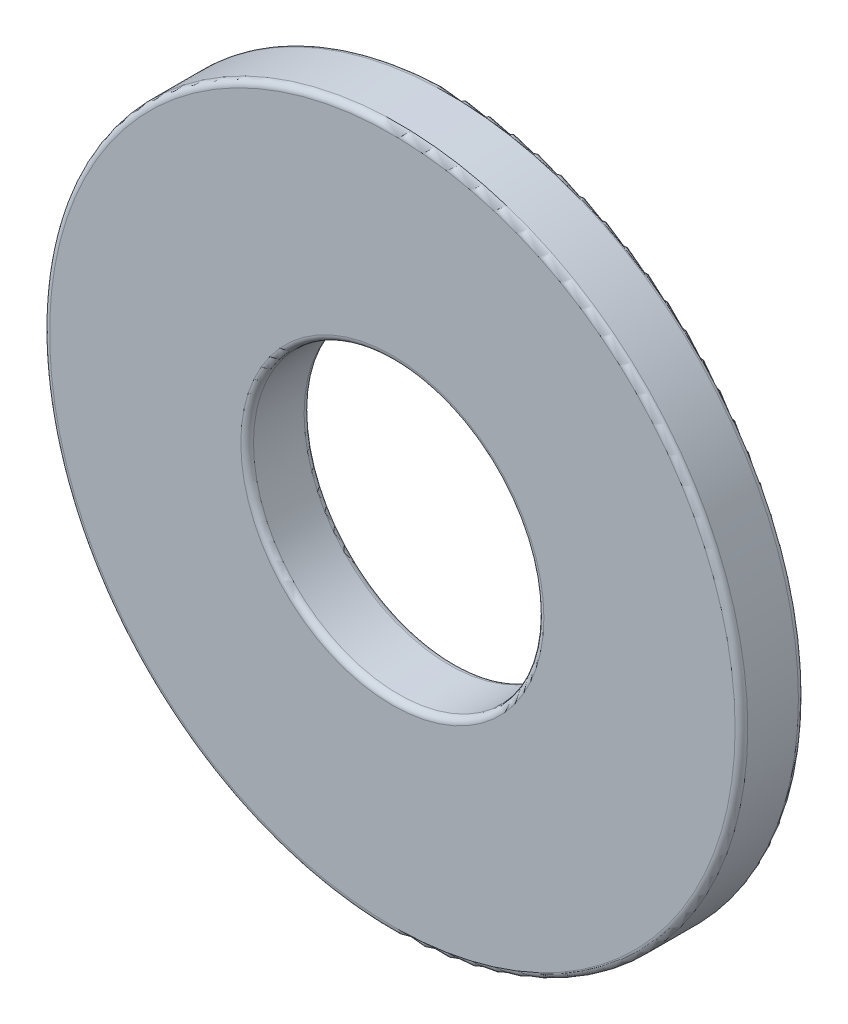
ISO-10303-21;
HEADER;
FILE_DESCRIPTION(('STEP AP214'),'2;1');
FILE_NAME('part.step','',(''),(''),'','','');
FILE_SCHEMA(('AUTOMOTIVE_DESIGN { 1 0 10303 214 1 1 1 1 }'));
ENDSEC;
DATA;
#1=APPLICATION_CONTEXT('core data for automotive mechanical design processes');
#2=APPLICATION_PROTOCOL_DEFINITION('international standard','automotive_design',2000,#1);
#3=PRODUCT_CONTEXT('',#1,'mechanical');
#4=PRODUCT('Part','Part','',(#3));
#5=PRODUCT_RELATED_PRODUCT_CATEGORY('part','',(#4));
#6=PRODUCT_DEFINITION_FORMATION('','',#4);
#7=PRODUCT_DEFINITION_CONTEXT('part definition',#1,'design');
#8=PRODUCT_DEFINITION('design','',#6,#7);
#9=PRODUCT_DEFINITION_SHAPE('','',#8);
#10=(LENGTH_UNIT() NAMED_UNIT(*) SI_UNIT(.MILLI.,.METRE.));
#11=(NAMED_UNIT(*) PLANE_ANGLE_UNIT() SI_UNIT($,.RADIAN.));
#12=(NAMED_UNIT(*) SI_UNIT($,.STERADIAN.) SOLID_ANGLE_UNIT());
#13=UNCERTAINTY_MEASURE_WITH_UNIT(LENGTH_MEASURE(1.E-05),#10,'distance_accuracy_value','');
#14=(GEOMETRIC_REPRESENTATION_CONTEXT(3) GLOBAL_UNCERTAINTY_ASSIGNED_CONTEXT((#13)) GLOBAL_UNIT_ASSIGNED_CONTEXT((#10,
#11,#12)) REPRESENTATION_CONTEXT('',''));
#15=CARTESIAN_POINT('',(0.,0.,0.));
#16=DIRECTION('',(0.,0.,1.));
#17=DIRECTION('',(1.,0.,0.));
#18=AXIS2_PLACEMENT_3D('',#15,#16,#17);
#19=CARTESIAN_POINT('',(0.,0.,-0.8636));
#20=DIRECTION('',(0.,0.,1.));
#21=DIRECTION('',(1.,0.,0.));
#22=AXIS2_PLACEMENT_3D('',#19,#20,#21);
#23=CYLINDRICAL_SURFACE('',#22,9.525);
#24=CARTESIAN_POINT('',(0.,0.,-0.69088));
#25=DIRECTION('',(0.,0.,1.));
#26=DIRECTION('',(1.,0.,0.));
#27=AXIS2_PLACEMENT_3D('',#24,#25,#26);
#28=CIRCLE('',#27,9.525);
#29=CARTESIAN_POINT('',(9.525,0.,-0.69088));
#30=VERTEX_POINT('',#29);
#31=EDGE_CURVE('E56',#30,#30,#28,.T.);
#32=ORIENTED_EDGE('',*,*,#31,.T.);
#33=EDGE_LOOP('',(#32));
#34=FACE_BOUND('',#33,.T.);
#35=CARTESIAN_POINT('',(0.,0.,0.69088));
#36=DIRECTION('',(0.,0.,1.));
#37=DIRECTION('',(1.,0.,0.));
#38=AXIS2_PLACEMENT_3D('',#35,#36,#37);
#39=CIRCLE('',#38,9.525);
#40=CARTESIAN_POINT('',(9.525,0.,0.69088));
#41=VERTEX_POINT('',#40);
#42=EDGE_CURVE('E59',#41,#41,#39,.F.);
#43=ORIENTED_EDGE('',*,*,#42,.T.);
#44=EDGE_LOOP('',(#43));
#45=FACE_BOUND('',#44,.T.);
#46=ADVANCED_FACE('F30',(#34,#45),#23,.T.);
#47=CARTESIAN_POINT('',(0.,0.,-0.8636));
#48=DIRECTION('',(0.,0.,1.));
#49=DIRECTION('',(1.,0.,0.));
#50=AXIS2_PLACEMENT_3D('',#47,#48,#49);
#51=PLANE('',#50);
#52=CARTESIAN_POINT('',(0.,0.,-0.8636));
#53=DIRECTION('',(0.,0.,1.));
#54=DIRECTION('',(1.,0.,0.));
#55=AXIS2_PLACEMENT_3D('',#52,#53,#54);
#56=CIRCLE('',#55,9.35228);
#57=CARTESIAN_POINT('',(9.35228,0.,-0.8636));
#58=VERTEX_POINT('',#57);
#59=EDGE_CURVE('E50',#58,#58,#56,.F.);
#60=ORIENTED_EDGE('',*,*,#59,.T.);
#61=EDGE_LOOP('',(#60));
#62=FACE_BOUND('',#61,.T.);
#63=CARTESIAN_POINT('',(0.,0.,-0.8636));
#64=DIRECTION('',(0.,0.,1.));
#65=DIRECTION('',(1.,0.,0.));
#66=AXIS2_PLACEMENT_3D('',#63,#64,#65);
#67=CIRCLE('',#66,4.13512);
#68=CARTESIAN_POINT('',(4.13512,0.,-0.8636));
#69=VERTEX_POINT('',#68);
#70=EDGE_CURVE('E53',#69,#69,#67,.T.);
#71=ORIENTED_EDGE('',*,*,#70,.T.);
#72=EDGE_LOOP('',(#71));
#73=FACE_BOUND('',#72,.T.);
#74=ADVANCED_FACE('F73',(#62,#73),#51,.F.);
#75=CARTESIAN_POINT('',(0.,0.,-0.8636));
#76=DIRECTION('',(0.,0.,1.));
#77=DIRECTION('',(1.,0.,0.));
#78=AXIS2_PLACEMENT_3D('',#75,#76,#77);
#79=CYLINDRICAL_SURFACE('',#78,3.9624);
#80=CARTESIAN_POINT('',(0.,0.,-0.69088));
#81=DIRECTION('',(0.,0.,1.));
#82=DIRECTION('',(1.,0.,0.));
#83=AXIS2_PLACEMENT_3D('',#80,#81,#82);
#84=CIRCLE('',#83,3.9624);
#85=CARTESIAN_POINT('',(3.9624,0.,-0.69088));
#86=VERTEX_POINT('',#85);
#87=EDGE_CURVE('E41',#86,#86,#84,.F.);
#88=ORIENTED_EDGE('',*,*,#87,.T.);
#89=EDGE_LOOP('',(#88));
#90=FACE_BOUND('',#89,.T.);
#91=CARTESIAN_POINT('',(0.,0.,0.69088));
#92=DIRECTION('',(0.,0.,1.));
#93=DIRECTION('',(1.,0.,0.));
#94=AXIS2_PLACEMENT_3D('',#91,#92,#93);
#95=CIRCLE('',#94,3.9624);
#96=CARTESIAN_POINT('',(3.9624,0.,0.69088));
#97=VERTEX_POINT('',#96);
#98=EDGE_CURVE('E45',#97,#97,#95,.T.);
#99=ORIENTED_EDGE('',*,*,#98,.T.);
#100=EDGE_LOOP('',(#99));
#101=FACE_BOUND('',#100,.T.);
#102=ADVANCED_FACE('F79',(#90,#101),#79,.F.);
#103=CARTESIAN_POINT('',(0.,0.,0.8636));
#104=DIRECTION('',(0.,0.,1.));
#105=DIRECTION('',(1.,0.,0.));
#106=AXIS2_PLACEMENT_3D('',#103,#104,#105);
#107=PLANE('',#106);
#108=CARTESIAN_POINT('',(0.,0.,0.8636));
#109=DIRECTION('',(0.,0.,1.));
#110=DIRECTION('',(1.,0.,0.));
#111=AXIS2_PLACEMENT_3D('',#108,#109,#110);
#112=CIRCLE('',#111,4.13512);
#113=CARTESIAN_POINT('',(4.13512,0.,0.8636));
#114=VERTEX_POINT('',#113);
#115=EDGE_CURVE('E10',#114,#114,#112,.F.);
#116=ORIENTED_EDGE('',*,*,#115,.T.);
#117=EDGE_LOOP('',(#116));
#118=FACE_BOUND('',#117,.T.);
#119=CARTESIAN_POINT('',(0.,0.,0.8636));
#120=DIRECTION('',(0.,0.,1.));
#121=DIRECTION('',(1.,0.,0.));
#122=AXIS2_PLACEMENT_3D('',#119,#120,#121);
#123=CIRCLE('',#122,9.35228);
#124=CARTESIAN_POINT('',(9.35228,0.,0.8636));
#125=VERTEX_POINT('',#124);
#126=EDGE_CURVE('E37',#125,#125,#123,.T.);
#127=ORIENTED_EDGE('',*,*,#126,.T.);
#128=EDGE_LOOP('',(#127));
#129=FACE_BOUND('',#128,.T.);
#130=ADVANCED_FACE('F87',(#118,#129),#107,.T.);
#131=CARTESIAN_POINT('',(0.,0.,-0.69088));
#132=DIRECTION('',(0.,0.,1.));
#133=DIRECTION('',(1.,0.,0.));
#134=AXIS2_PLACEMENT_3D('',#131,#132,#133);
#135=TOROIDAL_SURFACE('',#134,9.35228,0.17272);
#136=ORIENTED_EDGE('',*,*,#59,.F.);
#137=EDGE_LOOP('',(#136));
#138=FACE_BOUND('',#137,.T.);
#139=ORIENTED_EDGE('',*,*,#31,.F.);
#140=EDGE_LOOP('',(#139));
#141=FACE_BOUND('',#140,.T.);
#142=ADVANCED_FACE('F84',(#138,#141),#135,.T.);
#143=CARTESIAN_POINT('',(0.,0.,-0.69088));
#144=DIRECTION('',(0.,0.,1.));
#145=DIRECTION('',(1.,0.,0.));
#146=AXIS2_PLACEMENT_3D('',#143,#144,#145);
#147=TOROIDAL_SURFACE('',#146,4.13512,0.17272);
#148=ORIENTED_EDGE('',*,*,#87,.F.);
#149=EDGE_LOOP('',(#148));
#150=FACE_BOUND('',#149,.T.);
#151=ORIENTED_EDGE('',*,*,#70,.F.);
#152=EDGE_LOOP('',(#151));
#153=FACE_BOUND('',#152,.T.);
#154=ADVANCED_FACE('F70',(#150,#153),#147,.T.);
#155=CARTESIAN_POINT('',(0.,0.,0.69088));
#156=DIRECTION('',(0.,0.,1.));
#157=DIRECTION('',(1.,0.,0.));
#158=AXIS2_PLACEMENT_3D('',#155,#156,#157);
#159=TOROIDAL_SURFACE('',#158,4.13512,0.17272);
#160=ORIENTED_EDGE('',*,*,#115,.F.);
#161=EDGE_LOOP('',(#160));
#162=FACE_BOUND('',#161,.T.);
#163=ORIENTED_EDGE('',*,*,#98,.F.);
#164=EDGE_LOOP('',(#163));
#165=FACE_BOUND('',#164,.T.);
#166=ADVANCED_FACE('F66',(#162,#165),#159,.T.);
#167=CARTESIAN_POINT('',(0.,0.,0.69088));
#168=DIRECTION('',(0.,0.,1.));
#169=DIRECTION('',(1.,0.,0.));
#170=AXIS2_PLACEMENT_3D('',#167,#168,#169);
#171=TOROIDAL_SURFACE('',#170,9.35228,0.17272);
#172=ORIENTED_EDGE('',*,*,#42,.F.);
#173=EDGE_LOOP('',(#172));
#174=FACE_BOUND('',#173,.T.);
#175=ORIENTED_EDGE('',*,*,#126,.F.);
#176=EDGE_LOOP('',(#175));
#177=FACE_BOUND('',#176,.T.);
#178=ADVANCED_FACE('F32',(#174,#177),#171,.T.);
#179=CLOSED_SHELL('',(#46,#74,#102,#130,#142,#154,#166,#178));
#180=MANIFOLD_SOLID_BREP('B2',#179);
#181=ADVANCED_BREP_SHAPE_REPRESENTATION('',(#18,#180),#14);
#182=SHAPE_DEFINITION_REPRESENTATION(#9,#181);
ENDSEC;
END-ISO-10303-21;
